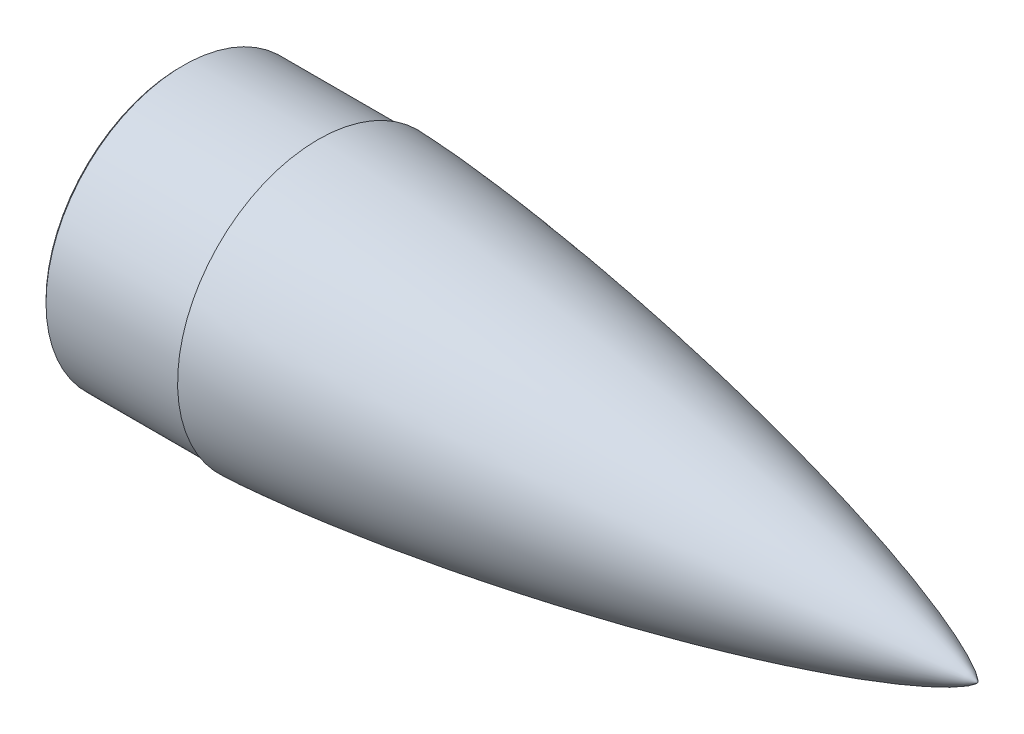
ISO-10303-21;
HEADER;
FILE_DESCRIPTION(('STEP AP214'),'2;1');
FILE_NAME('part.step','',(''),(''),'','','');
FILE_SCHEMA(('AUTOMOTIVE_DESIGN { 1 0 10303 214 1 1 1 1 }'));
ENDSEC;
DATA;
#1=APPLICATION_CONTEXT('core data for automotive mechanical design processes');
#2=APPLICATION_PROTOCOL_DEFINITION('international standard','automotive_design',2000,#1);
#3=PRODUCT_CONTEXT('',#1,'mechanical');
#4=PRODUCT('Part','Part','',(#3));
#5=PRODUCT_RELATED_PRODUCT_CATEGORY('part','',(#4));
#6=PRODUCT_DEFINITION_FORMATION('','',#4);
#7=PRODUCT_DEFINITION_CONTEXT('part definition',#1,'design');
#8=PRODUCT_DEFINITION('design','',#6,#7);
#9=PRODUCT_DEFINITION_SHAPE('','',#8);
#10=(LENGTH_UNIT() NAMED_UNIT(*) SI_UNIT(.MILLI.,.METRE.));
#11=(NAMED_UNIT(*) PLANE_ANGLE_UNIT() SI_UNIT($,.RADIAN.));
#12=(NAMED_UNIT(*) SI_UNIT($,.STERADIAN.) SOLID_ANGLE_UNIT());
#13=UNCERTAINTY_MEASURE_WITH_UNIT(LENGTH_MEASURE(1.E-05),#10,'distance_accuracy_value','');
#14=(GEOMETRIC_REPRESENTATION_CONTEXT(3) GLOBAL_UNCERTAINTY_ASSIGNED_CONTEXT((#13)) GLOBAL_UNIT_ASSIGNED_CONTEXT((#10,
#11,#12)) REPRESENTATION_CONTEXT('',''));
#15=CARTESIAN_POINT('',(0.,0.,0.));
#16=DIRECTION('',(0.,0.,1.));
#17=DIRECTION('',(1.,0.,0.));
#18=AXIS2_PLACEMENT_3D('',#15,#16,#17);
#19=CARTESIAN_POINT('',(-84.6045174731784,81.99983,0.));
#20=DIRECTION('',(-1.,0.,0.));
#21=DIRECTION('',(0.,0.,1.));
#22=AXIS2_PLACEMENT_3D('',#19,#20,#21);
#23=PLANE('',#22);
#24=CARTESIAN_POINT('',(-84.6045174731784,0.,0.));
#25=DIRECTION('',(-1.,0.,0.));
#26=DIRECTION('',(0.,0.,1.));
#27=AXIS2_PLACEMENT_3D('',#24,#25,#26);
#28=CIRCLE('',#27,83.49983);
#29=CARTESIAN_POINT('',(-84.6045174731784,0.,83.49983));
#30=VERTEX_POINT('',#29);
#31=EDGE_CURVE('E11',#30,#30,#28,.T.);
#32=ORIENTED_EDGE('',*,*,#31,.T.);
#33=EDGE_LOOP('',(#32));
#34=FACE_BOUND('',#33,.T.);
#35=CARTESIAN_POINT('',(-84.6045174731784,0.,0.));
#36=DIRECTION('',(1.,0.,0.));
#37=DIRECTION('',(0.,0.,-1.));
#38=AXIS2_PLACEMENT_3D('',#35,#36,#37);
#39=CIRCLE('',#38,81.99983);
#40=CARTESIAN_POINT('',(-84.6045174731784,0.,-81.99983));
#41=VERTEX_POINT('',#40);
#42=EDGE_CURVE('E64',#41,#41,#39,.T.);
#43=ORIENTED_EDGE('',*,*,#42,.T.);
#44=EDGE_LOOP('',(#43));
#45=FACE_BOUND('',#44,.T.);
#46=ADVANCED_FACE('F33',(#34,#45),#23,.T.);
#47=CARTESIAN_POINT('',(46.9178584693199,0.,0.));
#48=DIRECTION('',(1.,0.,0.));
#49=DIRECTION('',(0.,0.,-1.));
#50=AXIS2_PLACEMENT_3D('',#47,#48,#49);
#51=CYLINDRICAL_SURFACE('',#50,84.99983);
#52=CARTESIAN_POINT('',(-83.1045174731784,0.,0.));
#53=DIRECTION('',(-1.,0.,0.));
#54=DIRECTION('',(0.,0.,1.));
#55=AXIS2_PLACEMENT_3D('',#52,#53,#54);
#56=CIRCLE('',#55,84.99983);
#57=CARTESIAN_POINT('',(-83.1045174731784,0.,84.99983));
#58=VERTEX_POINT('',#57);
#59=EDGE_CURVE('E41',#58,#58,#56,.F.);
#60=ORIENTED_EDGE('',*,*,#59,.T.);
#61=EDGE_LOOP('',(#60));
#62=FACE_BOUND('',#61,.T.);
#63=CARTESIAN_POINT('',(0.395312526821567,0.,0.));
#64=DIRECTION('',(1.,0.,0.));
#65=DIRECTION('',(0.,0.,-1.));
#66=AXIS2_PLACEMENT_3D('',#63,#64,#65);
#67=CIRCLE('',#66,84.99983);
#68=CARTESIAN_POINT('',(0.395312526821567,0.,-84.99983));
#69=VERTEX_POINT('',#68);
#70=EDGE_CURVE('E61',#69,#69,#67,.T.);
#71=ORIENTED_EDGE('',*,*,#70,.F.);
#72=EDGE_LOOP('',(#71));
#73=FACE_BOUND('',#72,.T.);
#74=ADVANCED_FACE('F72',(#62,#73),#51,.T.);
#75=CARTESIAN_POINT('',(0.395312526821506,84.99983,0.));
#76=DIRECTION('',(-1.,0.,0.));
#77=DIRECTION('',(0.,0.,1.));
#78=AXIS2_PLACEMENT_3D('',#75,#76,#77);
#79=PLANE('',#78);
#80=ORIENTED_EDGE('',*,*,#70,.T.);
#81=EDGE_LOOP('',(#80));
#82=FACE_BOUND('',#81,.T.);
#83=CARTESIAN_POINT('',(0.395312526821442,0.,0.));
#84=DIRECTION('',(1.,0.,0.));
#85=DIRECTION('',(0.,0.,-1.));
#86=AXIS2_PLACEMENT_3D('',#83,#84,#85);
#87=CIRCLE('',#86,86.99983);
#88=CARTESIAN_POINT('',(0.395312526821442,0.,-86.99983));
#89=VERTEX_POINT('',#88);
#90=EDGE_CURVE('E57',#89,#89,#87,.T.);
#91=ORIENTED_EDGE('',*,*,#90,.F.);
#92=EDGE_LOOP('',(#91));
#93=FACE_BOUND('',#92,.T.);
#94=ADVANCED_FACE('F89',(#82,#93),#79,.T.);
#95=CARTESIAN_POINT('',(408.967251822671,0.,0.));
#96=CARTESIAN_POINT('',(408.964913524309,0.0135017388946303,0.));
#97=CARTESIAN_POINT('',(408.958040757842,0.0399160773368835,0.));
#98=CARTESIAN_POINT('',(408.936520440702,0.0904856976591331,0.));
#99=CARTESIAN_POINT('',(408.89222207581,0.174057132181965,0.));
#100=CARTESIAN_POINT('',(408.826281575483,0.275556802982871,0.));
#101=CARTESIAN_POINT('',(408.721696416073,0.415833756400021,0.));
#102=CARTESIAN_POINT('',(408.561101809182,0.605075244665577,0.));
#103=CARTESIAN_POINT('',(408.305619180198,0.872424149776899,0.));
#104=CARTESIAN_POINT('',(407.869667129884,1.27529956193635,0.));
#105=CARTESIAN_POINT('',(407.120955137874,1.88514211511049,0.));
#106=CARTESIAN_POINT('',(405.803773451327,2.8259018501857,0.));
#107=CARTESIAN_POINT('',(403.462406920435,4.28715279437305,0.));
#108=CARTESIAN_POINT('',(399.325294487522,6.53181845443187,0.));
#109=CARTESIAN_POINT('',(392.481146887534,9.75890464929676,0.));
#110=CARTESIAN_POINT('',(380.662076725118,14.628008466058,0.));
#111=CARTESIAN_POINT('',(363.637187185103,20.7117203818523,0.));
#112=CARTESIAN_POINT('',(342.215241093199,27.476512988503,0.));
#113=CARTESIAN_POINT('',(317.428462321169,34.4976264699902,0.));
#114=CARTESIAN_POINT('',(291.879335737445,41.1048243902447,0.));
#115=CARTESIAN_POINT('',(266.210460920412,47.2289931688774,0.));
#116=CARTESIAN_POINT('',(240.445488359744,52.9334367772789,0.));
#117=CARTESIAN_POINT('',(214.598861982297,58.2554390089734,0.));
#118=CARTESIAN_POINT('',(188.680895660279,63.2175826932426,0.));
#119=CARTESIAN_POINT('',(165.946174917208,67.2532806785126,0.));
#120=CARTESIAN_POINT('',(146.421982586261,70.4937997215436,0.));
#121=CARTESIAN_POINT('',(130.127893898103,73.0449474678022,0.));
#122=CARTESIAN_POINT('',(117.078590637244,74.994157933287,0.));
#123=CARTESIAN_POINT('',(104.015464216165,76.8485407904921,0.));
#124=CARTESIAN_POINT('',(92.5732639587286,78.3844920450082,0.));
#125=CARTESIAN_POINT('',(82.757139440995,79.6356039727628,0.));
#126=CARTESIAN_POINT('',(74.5713401839697,80.6322199022326,0.));
#127=CARTESIAN_POINT('',(68.0192604541921,81.4008042107162,0.));
#128=CARTESIAN_POINT('',(61.4637233644967,82.1393758993439,0.));
#129=CARTESIAN_POINT('',(54.904698020018,82.8463772595978,0.));
#130=CARTESIAN_POINT('',(48.3421599181037,83.5199405058238,0.));
#131=CARTESIAN_POINT('',(41.7760575593893,84.1577871701676,0.));
#132=CARTESIAN_POINT('',(36.0275410798151,84.6821572388814,0.));
#133=CARTESIAN_POINT('',(31.097921258978,85.1052349120102,0.));
#134=CARTESIAN_POINT('',(26.9883179227046,85.4386698248277,0.));
#135=CARTESIAN_POINT('',(23.6996666177478,85.6932185939728,0.));
#136=CARTESIAN_POINT('',(20.0858078220367,85.9584480380997,0.));
#137=CARTESIAN_POINT('',(16.7198738206758,86.1890184851633,0.));
#138=CARTESIAN_POINT('',(13.6020982871385,86.3869667789933,0.));
#139=CARTESIAN_POINT('',(10.7327040130569,86.5545757438157,0.));
#140=CARTESIAN_POINT('',(8.43663500836282,86.6787032911545,0.));
#141=CARTESIAN_POINT('',(6.13999734052088,86.7921575854767,0.));
#142=CARTESIAN_POINT('',(4.12989206270139,86.8793132637732,0.));
#143=CARTESIAN_POINT('',(2.40653858007264,86.9446189815575,0.));
#144=CARTESIAN_POINT('',(1.25734863548316,86.9790224955032,0.));
#145=CARTESIAN_POINT('',(0.682697909866076,86.9949146203242,0.));
#146=CARTESIAN_POINT('',(0.395312526821445,86.99983,0.));
#147=B_SPLINE_CURVE_WITH_KNOTS('',4,(#95,#96,#97,#98,#99,#100,#101,#102,#103,#104,#105,#106,
#107,#108,#109,#110,#111,#112,#113,#114,#115,#116,#117,#118,#119,#120,#121,#122,#123,#124,#125,
#126,#127,#128,#129,#130,#131,#132,#133,#134,#135,#136,#137,#138,#139,#140,#141,#142,#143,#144,
#145,#146),.UNSPECIFIED.,.F.,.F.,(5,1,1,1,1,1,1,1,1,1,1,1,1,1,1,1,1,1,1,1,1,1,1,1,1,1,1,1,1,1,1,
1,1,1,1,1,1,1,1,1,1,1,1,1,1,1,1,1,5),(0.,0.000130122730793774,0.000260245461587547,
0.000520490923175095,0.000900390598891898,0.0012802902746087,0.00192509879202123,
0.00288150817718921,0.00441820752915464,0.00692708577491599,0.0111106973974526,
0.0182791377136376,0.0306727604209067,0.051704468996729,0.0831022801208259,0.139908797407073,
0.202702512646724,0.26549616528218,0.328289681584927,0.391083359416936,0.453876973450593,
0.516670577319054,0.579464196659418,0.642257765268514,0.673654596336679,0.705051427404843,
0.736448266643587,0.76784510588233,0.799241873583516,0.814940257434108,0.830638641284701,
0.846337072983396,0.862035504682092,0.877733936380787,0.893432368079482,0.909130719940439,
0.924829071801395,0.932678247731873,0.940527423662352,0.94837659959283,0.956225775523308,
0.967169331642481,0.972641109702068,0.978112887761654,0.983584665821241,0.989056443880827,
0.994528221940413,0.997264110970207,1.),.UNSPECIFIED.);
#148=CARTESIAN_POINT('',(46.9178584693199,0.,0.));
#149=DIRECTION('',(1.,0.,0.));
#150=AXIS1_PLACEMENT('',#148,#149);
#151=SURFACE_OF_REVOLUTION('',#147,#150);
#152=ORIENTED_EDGE('',*,*,#90,.T.);
#153=EDGE_LOOP('',(#152));
#154=FACE_BOUND('',#153,.T.);
#155=CARTESIAN_POINT('',(408.967251822671,0.,0.));
#156=VERTEX_POINT('',#155);
#157=VERTEX_LOOP('',#156);
#158=FACE_BOUND('',#157,.T.);
#159=ADVANCED_FACE('F51',(#154,#158),#151,.F.);
#160=CARTESIAN_POINT('',(129.304508698443,67.4998299999695,0.));
#161=CARTESIAN_POINT('',(129.562757302563,67.4558598828864,0.));
#162=CARTESIAN_POINT('',(132.679425235999,66.9245174442658,0.));
#163=CARTESIAN_POINT('',(141.509051931074,65.395628269302,0.));
#164=CARTESIAN_POINT('',(156.03456787351,62.7717153652316,0.));
#165=CARTESIAN_POINT('',(175.966897581105,58.9342556437838,0.));
#166=CARTESIAN_POINT('',(198.683967628958,54.2345009270161,0.));
#167=CARTESIAN_POINT('',(221.331994001222,49.212017940881,0.));
#168=CARTESIAN_POINT('',(243.90137912285,43.8468951855248,0.));
#169=CARTESIAN_POINT('',(266.378532844804,38.106125474283,0.));
#170=CARTESIAN_POINT('',(288.741266406197,31.9336935083646,0.));
#171=CARTESIAN_POINT('',(310.425167901858,25.3985692586692,0.));
#172=CARTESIAN_POINT('',(329.152005397616,19.1284839647496,0.));
#173=CARTESIAN_POINT('',(344.042994900832,13.5076950112197,0.));
#174=CARTESIAN_POINT('',(354.402196649447,9.01831006956192,0.));
#175=CARTESIAN_POINT('',(360.425978756185,6.04073439622553,0.));
#176=CARTESIAN_POINT('',(364.092823889542,3.96003232781514,0.));
#177=CARTESIAN_POINT('',(366.176060795862,2.60155915402352,0.));
#178=CARTESIAN_POINT('',(367.344738263332,1.72985368517451,0.));
#179=CARTESIAN_POINT('',(368.008659120661,1.1649049648713,0.));
#180=CARTESIAN_POINT('',(368.392888737311,0.793577299361299,0.));
#181=CARTESIAN_POINT('',(368.616653261937,0.548352839719824,0.));
#182=CARTESIAN_POINT('',(368.75569012407,0.376555746293117,0.));
#183=CARTESIAN_POINT('',(368.845538096967,0.250270687361392,0.));
#184=CARTESIAN_POINT('',(368.902304551544,0.158736421423559,0.));
#185=CARTESIAN_POINT('',(368.940636146556,0.0829640066765009,0.));
#186=CARTESIAN_POINT('',(368.959416882334,0.0365183779116873,0.));
#187=CARTESIAN_POINT('',(368.965299542606,0.0123384894312348,0.));
#188=CARTESIAN_POINT('',(368.967251822671,0.,0.));
#189=B_SPLINE_CURVE_WITH_KNOTS('',4,(#160,#161,#162,#163,#164,#165,#166,#167,#168,#169,#170,
#171,#172,#173,#174,#175,#176,#177,#178,#179,#180,#181,#182,#183,#184,#185,#186,#187,#188),
.UNSPECIFIED.,.F.,.F.,(5,1,1,1,1,1,1,1,1,1,1,1,1,1,1,1,1,1,1,1,1,1,1,1,1,5),(0.,
0.00283647920436636,0.0342332444504888,0.0970268810083452,0.159820508547191,0.222614108737372,
0.285407697382581,0.348201256138961,0.410995008794338,0.473788580675643,0.536581936684254,
0.593389064110819,0.624786593083934,0.646068205580129,0.658784205850804,0.666111808974739,
0.670410760232524,0.672980202977102,0.674560712871747,0.675544641713486,0.676192795139539,
0.676572535039374,0.67695227493921,0.677222173692457,0.677357123069081,0.677492072445704),.UNSPECIFIED.);
#190=CARTESIAN_POINT('',(46.9178584693199,0.,0.));
#191=DIRECTION('',(1.,0.,0.));
#192=AXIS1_PLACEMENT('',#190,#191);
#193=SURFACE_OF_REVOLUTION('',#189,#192);
#194=CARTESIAN_POINT('',(368.967251822671,0.,0.));
#195=VERTEX_POINT('',#194);
#196=VERTEX_LOOP('',#195);
#197=FACE_BOUND('',#196,.T.);
#198=CARTESIAN_POINT('',(129.304508698441,0.,0.));
#199=DIRECTION('',(1.,0.,0.));
#200=DIRECTION('',(0.,0.,-1.));
#201=AXIS2_PLACEMENT_3D('',#198,#199,#200);
#202=CIRCLE('',#201,67.4998299999698);
#203=CARTESIAN_POINT('',(129.304508698441,0.,-67.4998299999698));
#204=VERTEX_POINT('',#203);
#205=EDGE_CURVE('E55',#204,#204,#202,.T.);
#206=ORIENTED_EDGE('',*,*,#205,.F.);
#207=EDGE_LOOP('',(#206));
#208=FACE_BOUND('',#207,.T.);
#209=ADVANCED_FACE('F47',(#197,#208),#193,.F.);
#210=CARTESIAN_POINT('',(-85.3459203878006,0.,0.));
#211=DIRECTION('',(1.,0.,0.));
#212=DIRECTION('',(0.,0.,-1.));
#213=AXIS2_PLACEMENT_3D('',#210,#211,#212);
#214=DEGENERATE_TOROIDAL_SURFACE('',#213,1193.20124069395,1278.84400782726,.F.);
#215=ORIENTED_EDGE('',*,*,#205,.T.);
#216=EDGE_LOOP('',(#215));
#217=FACE_BOUND('',#216,.T.);
#218=CARTESIAN_POINT('',(11.1124937434031,0.,0.));
#219=DIRECTION('',(1.,0.,0.));
#220=DIRECTION('',(0.,0.,-1.));
#221=AXIS2_PLACEMENT_3D('',#218,#219,#220);
#222=CIRCLE('',#221,81.99983);
#223=CARTESIAN_POINT('',(11.1124937434031,0.,-81.99983));
#224=VERTEX_POINT('',#223);
#225=EDGE_CURVE('E58',#224,#224,#222,.T.);
#226=ORIENTED_EDGE('',*,*,#225,.F.);
#227=EDGE_LOOP('',(#226));
#228=FACE_BOUND('',#227,.T.);
#229=ADVANCED_FACE('F50',(#217,#228),#214,.T.);
#230=CARTESIAN_POINT('',(46.9178584693199,0.,0.));
#231=DIRECTION('',(1.,0.,0.));
#232=DIRECTION('',(0.,0.,-1.));
#233=AXIS2_PLACEMENT_3D('',#230,#231,#232);
#234=CYLINDRICAL_SURFACE('',#233,81.99983);
#235=ORIENTED_EDGE('',*,*,#225,.T.);
#236=EDGE_LOOP('',(#235));
#237=FACE_BOUND('',#236,.T.);
#238=ORIENTED_EDGE('',*,*,#42,.F.);
#239=EDGE_LOOP('',(#238));
#240=FACE_BOUND('',#239,.T.);
#241=ADVANCED_FACE('F76',(#237,#240),#234,.F.);
#242=CARTESIAN_POINT('',(-83.1045174731784,0.,0.));
#243=DIRECTION('',(1.,0.,0.));
#244=DIRECTION('',(0.,0.,-1.));
#245=AXIS2_PLACEMENT_3D('',#242,#243,#244);
#246=CONICAL_SURFACE('',#245,84.99983,0.785398163397467);
#247=ORIENTED_EDGE('',*,*,#31,.F.);
#248=EDGE_LOOP('',(#247));
#249=FACE_BOUND('',#248,.T.);
#250=ORIENTED_EDGE('',*,*,#59,.F.);
#251=EDGE_LOOP('',(#250));
#252=FACE_BOUND('',#251,.T.);
#253=ADVANCED_FACE('F35',(#249,#252),#246,.T.);
#254=CLOSED_SHELL('',(#46,#74,#94,#159,#209,#229,#241,#253));
#255=MANIFOLD_SOLID_BREP('B2',#254);
#256=ADVANCED_BREP_SHAPE_REPRESENTATION('',(#18,#255),#14);
#257=SHAPE_DEFINITION_REPRESENTATION(#9,#256);
ENDSEC;
END-ISO-10303-21;
